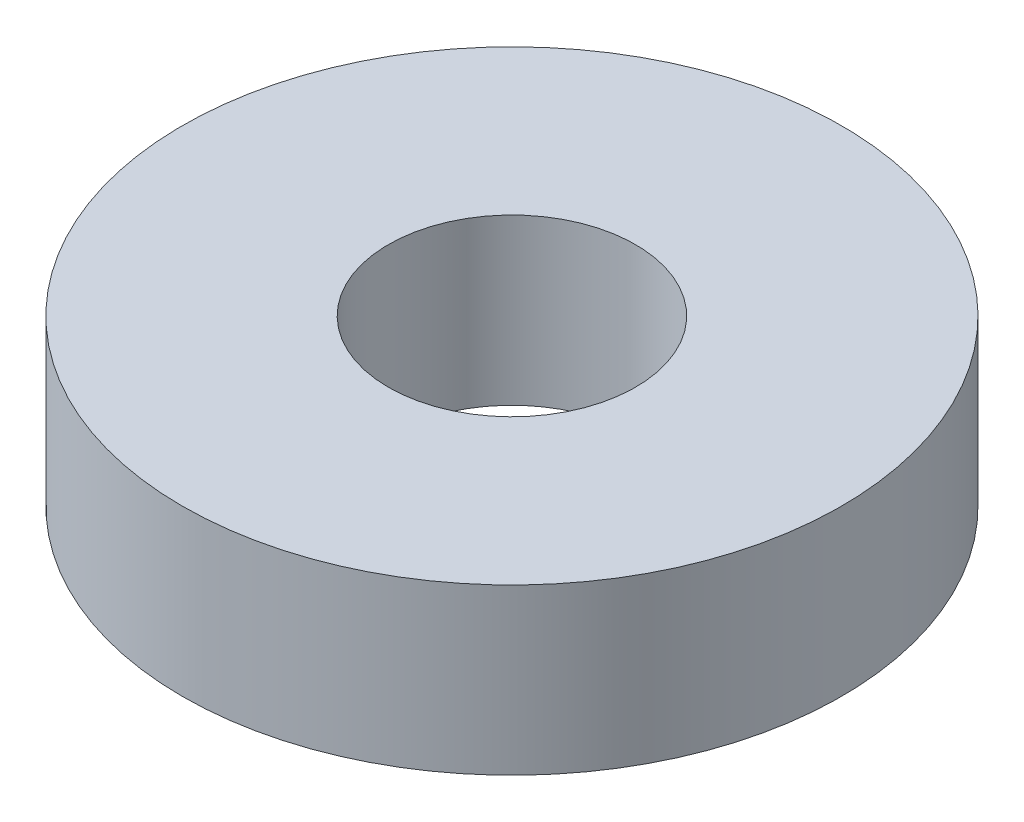
ISO-10303-21;
HEADER;
FILE_DESCRIPTION(('STEP AP214'),'2;1');
FILE_NAME('part.step','',(''),(''),'','','');
FILE_SCHEMA(('AUTOMOTIVE_DESIGN { 1 0 10303 214 1 1 1 1 }'));
ENDSEC;
DATA;
#1=APPLICATION_CONTEXT('core data for automotive mechanical design processes');
#2=APPLICATION_PROTOCOL_DEFINITION('international standard','automotive_design',2000,#1);
#3=PRODUCT_CONTEXT('',#1,'mechanical');
#4=PRODUCT('Part','Part','',(#3));
#5=PRODUCT_RELATED_PRODUCT_CATEGORY('part','',(#4));
#6=PRODUCT_DEFINITION_FORMATION('','',#4);
#7=PRODUCT_DEFINITION_CONTEXT('part definition',#1,'design');
#8=PRODUCT_DEFINITION('design','',#6,#7);
#9=PRODUCT_DEFINITION_SHAPE('','',#8);
#10=(LENGTH_UNIT() NAMED_UNIT(*) SI_UNIT(.MILLI.,.METRE.));
#11=(NAMED_UNIT(*) PLANE_ANGLE_UNIT() SI_UNIT($,.RADIAN.));
#12=(NAMED_UNIT(*) SI_UNIT($,.STERADIAN.) SOLID_ANGLE_UNIT());
#13=UNCERTAINTY_MEASURE_WITH_UNIT(LENGTH_MEASURE(1.E-05),#10,'distance_accuracy_value','');
#14=(GEOMETRIC_REPRESENTATION_CONTEXT(3) GLOBAL_UNCERTAINTY_ASSIGNED_CONTEXT((#13)) GLOBAL_UNIT_ASSIGNED_CONTEXT((#10,
#11,#12)) REPRESENTATION_CONTEXT('',''));
#15=CARTESIAN_POINT('',(0.,0.,0.));
#16=DIRECTION('',(0.,0.,1.));
#17=DIRECTION('',(1.,0.,0.));
#18=AXIS2_PLACEMENT_3D('',#15,#16,#17);
#19=CARTESIAN_POINT('',(0.,10.,0.));
#20=DIRECTION('',(0.,1.,0.));
#21=DIRECTION('',(0.,0.,1.));
#22=AXIS2_PLACEMENT_3D('',#19,#20,#21);
#23=PLANE('',#22);
#24=CARTESIAN_POINT('',(0.,10.,0.));
#25=DIRECTION('',(0.,1.,0.));
#26=DIRECTION('',(0.,0.,1.));
#27=AXIS2_PLACEMENT_3D('',#24,#25,#26);
#28=CIRCLE('',#27,20.);
#29=CARTESIAN_POINT('',(0.,10.,20.));
#30=VERTEX_POINT('',#29);
#31=EDGE_CURVE('E10',#30,#30,#28,.T.);
#32=ORIENTED_EDGE('',*,*,#31,.T.);
#33=EDGE_LOOP('',(#32));
#34=FACE_BOUND('',#33,.T.);
#35=CARTESIAN_POINT('',(0.,10.,0.));
#36=DIRECTION('',(0.,1.,0.));
#37=DIRECTION('',(0.,0.,1.));
#38=AXIS2_PLACEMENT_3D('',#35,#36,#37);
#39=CIRCLE('',#38,7.5);
#40=CARTESIAN_POINT('',(0.,10.,7.5));
#41=VERTEX_POINT('',#40);
#42=EDGE_CURVE('E56',#41,#41,#39,.T.);
#43=ORIENTED_EDGE('',*,*,#42,.F.);
#44=EDGE_LOOP('',(#43));
#45=FACE_BOUND('',#44,.T.);
#46=ADVANCED_FACE('F45',(#34,#45),#23,.T.);
#47=CARTESIAN_POINT('',(0.,0.,0.));
#48=DIRECTION('',(0.,1.,0.));
#49=DIRECTION('',(0.,0.,1.));
#50=AXIS2_PLACEMENT_3D('',#47,#48,#49);
#51=PLANE('',#50);
#52=CARTESIAN_POINT('',(0.,0.,0.));
#53=DIRECTION('',(0.,1.,0.));
#54=DIRECTION('',(0.,0.,1.));
#55=AXIS2_PLACEMENT_3D('',#52,#53,#54);
#56=CIRCLE('',#55,20.);
#57=CARTESIAN_POINT('',(0.,0.,20.));
#58=VERTEX_POINT('',#57);
#59=EDGE_CURVE('E49',#58,#58,#56,.T.);
#60=ORIENTED_EDGE('',*,*,#59,.F.);
#61=EDGE_LOOP('',(#60));
#62=FACE_BOUND('',#61,.T.);
#63=CARTESIAN_POINT('',(0.,0.,0.));
#64=DIRECTION('',(0.,1.,0.));
#65=DIRECTION('',(0.,0.,1.));
#66=AXIS2_PLACEMENT_3D('',#63,#64,#65);
#67=CIRCLE('',#66,7.5);
#68=CARTESIAN_POINT('',(0.,0.,7.5));
#69=VERTEX_POINT('',#68);
#70=EDGE_CURVE('E58',#69,#69,#67,.T.);
#71=ORIENTED_EDGE('',*,*,#70,.T.);
#72=EDGE_LOOP('',(#71));
#73=FACE_BOUND('',#72,.T.);
#74=ADVANCED_FACE('F68',(#62,#73),#51,.F.);
#75=CARTESIAN_POINT('',(0.,10.,0.));
#76=DIRECTION('',(0.,-1.,0.));
#77=DIRECTION('',(0.,0.,-1.));
#78=AXIS2_PLACEMENT_3D('',#75,#76,#77);
#79=CYLINDRICAL_SURFACE('',#78,20.);
#80=ORIENTED_EDGE('',*,*,#31,.F.);
#81=EDGE_LOOP('',(#80));
#82=FACE_BOUND('',#81,.T.);
#83=ORIENTED_EDGE('',*,*,#59,.T.);
#84=EDGE_LOOP('',(#83));
#85=FACE_BOUND('',#84,.T.);
#86=ADVANCED_FACE('F47',(#82,#85),#79,.T.);
#87=CARTESIAN_POINT('',(0.,10.,0.));
#88=DIRECTION('',(0.,-1.,0.));
#89=DIRECTION('',(0.,0.,-1.));
#90=AXIS2_PLACEMENT_3D('',#87,#88,#89);
#91=CYLINDRICAL_SURFACE('',#90,7.5);
#92=ORIENTED_EDGE('',*,*,#42,.T.);
#93=EDGE_LOOP('',(#92));
#94=FACE_BOUND('',#93,.T.);
#95=ORIENTED_EDGE('',*,*,#70,.F.);
#96=EDGE_LOOP('',(#95));
#97=FACE_BOUND('',#96,.T.);
#98=ADVANCED_FACE('F64',(#94,#97),#91,.F.);
#99=CLOSED_SHELL('',(#46,#74,#86,#98));
#100=MANIFOLD_SOLID_BREP('B2',#99);
#101=ADVANCED_BREP_SHAPE_REPRESENTATION('',(#18,#100),#14);
#102=SHAPE_DEFINITION_REPRESENTATION(#9,#101);
ENDSEC;
END-ISO-10303-21;
